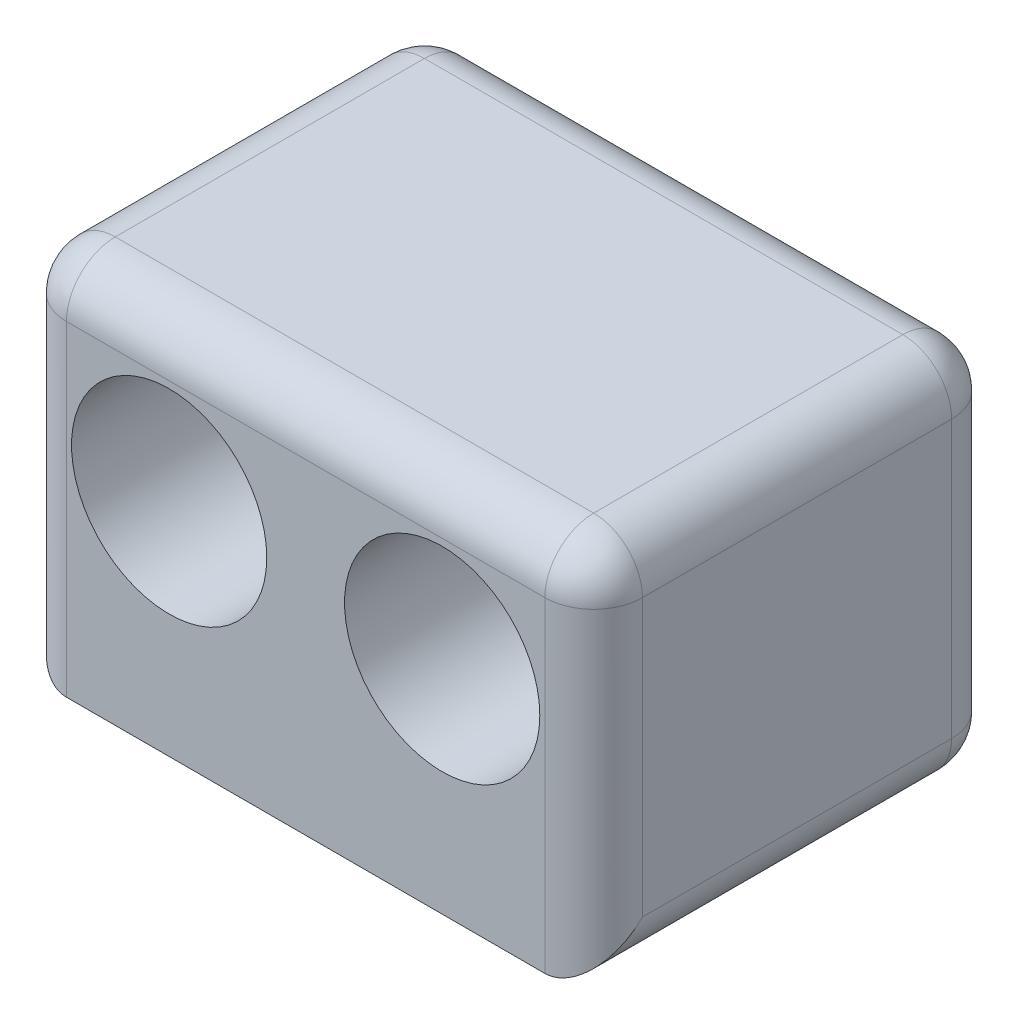
ISO-10303-21;
HEADER;
FILE_DESCRIPTION(('STEP AP214'),'2;1');
FILE_NAME('part.step','',(''),(''),'','','');
FILE_SCHEMA(('AUTOMOTIVE_DESIGN { 1 0 10303 214 1 1 1 1 }'));
ENDSEC;
DATA;
#1=APPLICATION_CONTEXT('core data for automotive mechanical design processes');
#2=APPLICATION_PROTOCOL_DEFINITION('international standard','automotive_design',2000,#1);
#3=PRODUCT_CONTEXT('',#1,'mechanical');
#4=PRODUCT('Part','Part','',(#3));
#5=PRODUCT_RELATED_PRODUCT_CATEGORY('part','',(#4));
#6=PRODUCT_DEFINITION_FORMATION('','',#4);
#7=PRODUCT_DEFINITION_CONTEXT('part definition',#1,'design');
#8=PRODUCT_DEFINITION('design','',#6,#7);
#9=PRODUCT_DEFINITION_SHAPE('','',#8);
#10=(LENGTH_UNIT() NAMED_UNIT(*) SI_UNIT(.MILLI.,.METRE.));
#11=(NAMED_UNIT(*) PLANE_ANGLE_UNIT() SI_UNIT($,.RADIAN.));
#12=(NAMED_UNIT(*) SI_UNIT($,.STERADIAN.) SOLID_ANGLE_UNIT());
#13=UNCERTAINTY_MEASURE_WITH_UNIT(LENGTH_MEASURE(1.E-05),#10,'distance_accuracy_value','');
#14=(GEOMETRIC_REPRESENTATION_CONTEXT(3) GLOBAL_UNCERTAINTY_ASSIGNED_CONTEXT((#13)) GLOBAL_UNIT_ASSIGNED_CONTEXT((#10,
#11,#12)) REPRESENTATION_CONTEXT('',''));
#15=CARTESIAN_POINT('',(0.,0.,0.));
#16=DIRECTION('',(0.,0.,1.));
#17=DIRECTION('',(1.,0.,0.));
#18=AXIS2_PLACEMENT_3D('',#15,#16,#17);
#19=CARTESIAN_POINT('',(8.85,5.75,12.5));
#20=DIRECTION('',(-1.,0.,0.));
#21=DIRECTION('',(0.,-1.,0.));
#22=AXIS2_PLACEMENT_3D('',#19,#20,#21);
#23=PLANE('',#22);
#24=DIRECTION('',(0.,1.,0.));
#25=VECTOR('',#24,1.);
#26=CARTESIAN_POINT('',(8.85,-5.75,11.));
#27=LINE('',#26,#25);
#28=CARTESIAN_POINT('',(8.85,4.25,11.));
#29=VERTEX_POINT('',#28);
#30=CARTESIAN_POINT('',(8.85,-4.25,11.));
#31=VERTEX_POINT('',#30);
#32=EDGE_CURVE('E58',#29,#31,#27,.F.);
#33=ORIENTED_EDGE('',*,*,#32,.T.);
#34=DIRECTION('',(0.,0.,-1.));
#35=VECTOR('',#34,1.);
#36=CARTESIAN_POINT('',(8.85,-4.25,12.5));
#37=LINE('',#36,#35);
#38=CARTESIAN_POINT('',(8.85,-4.25,1.5));
#39=VERTEX_POINT('',#38);
#40=EDGE_CURVE('E11',#31,#39,#37,.T.);
#41=ORIENTED_EDGE('',*,*,#40,.T.);
#42=DIRECTION('',(0.,1.,0.));
#43=VECTOR('',#42,1.);
#44=CARTESIAN_POINT('',(8.85,5.75,1.5));
#45=LINE('',#44,#43);
#46=CARTESIAN_POINT('',(8.85,4.25,1.5));
#47=VERTEX_POINT('',#46);
#48=EDGE_CURVE('E47',#39,#47,#45,.T.);
#49=ORIENTED_EDGE('',*,*,#48,.T.);
#50=DIRECTION('',(0.,0.,-1.));
#51=VECTOR('',#50,1.);
#52=CARTESIAN_POINT('',(8.85,4.25,12.5));
#53=LINE('',#52,#51);
#54=EDGE_CURVE('E236',#47,#29,#53,.F.);
#55=ORIENTED_EDGE('',*,*,#54,.T.);
#56=EDGE_LOOP('',(#33,#41,#49,#55));
#57=FACE_BOUND('',#56,.T.);
#58=ADVANCED_FACE('F38',(#57),#23,.F.);
#59=CARTESIAN_POINT('',(-8.85,5.75,12.5));
#60=DIRECTION('',(0.,-1.,0.));
#61=DIRECTION('',(0.,0.,-1.));
#62=AXIS2_PLACEMENT_3D('',#59,#60,#61);
#63=PLANE('',#62);
#64=DIRECTION('',(-1.,0.,0.));
#65=VECTOR('',#64,1.);
#66=CARTESIAN_POINT('',(-8.85,5.75,1.5));
#67=LINE('',#66,#65);
#68=CARTESIAN_POINT('',(7.35,5.75,1.5));
#69=VERTEX_POINT('',#68);
#70=CARTESIAN_POINT('',(-7.35,5.75,1.5));
#71=VERTEX_POINT('',#70);
#72=EDGE_CURVE('E211',#69,#71,#67,.T.);
#73=ORIENTED_EDGE('',*,*,#72,.T.);
#74=DIRECTION('',(0.,0.,-1.));
#75=VECTOR('',#74,1.);
#76=CARTESIAN_POINT('',(-7.35,5.75,12.5));
#77=LINE('',#76,#75);
#78=CARTESIAN_POINT('',(-7.35,5.75,11.));
#79=VERTEX_POINT('',#78);
#80=EDGE_CURVE('E216',#71,#79,#77,.F.);
#81=ORIENTED_EDGE('',*,*,#80,.T.);
#82=DIRECTION('',(-1.,0.,0.));
#83=VECTOR('',#82,1.);
#84=CARTESIAN_POINT('',(8.85,5.75,11.));
#85=LINE('',#84,#83);
#86=CARTESIAN_POINT('',(7.35,5.75,11.));
#87=VERTEX_POINT('',#86);
#88=EDGE_CURVE('E213',#79,#87,#85,.F.);
#89=ORIENTED_EDGE('',*,*,#88,.T.);
#90=DIRECTION('',(0.,0.,-1.));
#91=VECTOR('',#90,1.);
#92=CARTESIAN_POINT('',(7.35,5.75,12.5));
#93=LINE('',#92,#91);
#94=EDGE_CURVE('E209',#87,#69,#93,.T.);
#95=ORIENTED_EDGE('',*,*,#94,.T.);
#96=EDGE_LOOP('',(#73,#81,#89,#95));
#97=FACE_BOUND('',#96,.T.);
#98=ADVANCED_FACE('F265',(#97),#63,.F.);
#99=CARTESIAN_POINT('',(-8.85,5.75,12.5));
#100=DIRECTION('',(1.,0.,0.));
#101=DIRECTION('',(0.,1.,0.));
#102=AXIS2_PLACEMENT_3D('',#99,#100,#101);
#103=PLANE('',#102);
#104=DIRECTION('',(0.,-1.,0.));
#105=VECTOR('',#104,1.);
#106=CARTESIAN_POINT('',(-8.85,5.75,1.5));
#107=LINE('',#106,#105);
#108=CARTESIAN_POINT('',(-8.85,4.25,1.5));
#109=VERTEX_POINT('',#108);
#110=CARTESIAN_POINT('',(-8.85,-4.25,1.5));
#111=VERTEX_POINT('',#110);
#112=EDGE_CURVE('E231',#109,#111,#107,.T.);
#113=ORIENTED_EDGE('',*,*,#112,.T.);
#114=DIRECTION('',(0.,0.,-1.));
#115=VECTOR('',#114,1.);
#116=CARTESIAN_POINT('',(-8.85,-4.25,12.5));
#117=LINE('',#116,#115);
#118=CARTESIAN_POINT('',(-8.85,-4.25,11.));
#119=VERTEX_POINT('',#118);
#120=EDGE_CURVE('E234',#111,#119,#117,.F.);
#121=ORIENTED_EDGE('',*,*,#120,.T.);
#122=DIRECTION('',(0.,-1.,0.));
#123=VECTOR('',#122,1.);
#124=CARTESIAN_POINT('',(-8.85,5.75,11.));
#125=LINE('',#124,#123);
#126=CARTESIAN_POINT('',(-8.85,4.25,11.));
#127=VERTEX_POINT('',#126);
#128=EDGE_CURVE('E153',#119,#127,#125,.F.);
#129=ORIENTED_EDGE('',*,*,#128,.T.);
#130=DIRECTION('',(0.,0.,-1.));
#131=VECTOR('',#130,1.);
#132=CARTESIAN_POINT('',(-8.85,4.25,12.5));
#133=LINE('',#132,#131);
#134=EDGE_CURVE('E228',#127,#109,#133,.T.);
#135=ORIENTED_EDGE('',*,*,#134,.T.);
#136=EDGE_LOOP('',(#113,#121,#129,#135));
#137=FACE_BOUND('',#136,.T.);
#138=ADVANCED_FACE('F279',(#137),#103,.F.);
#139=CARTESIAN_POINT('',(-8.85,-5.75,12.5));
#140=DIRECTION('',(0.,1.,0.));
#141=DIRECTION('',(0.,0.,1.));
#142=AXIS2_PLACEMENT_3D('',#139,#140,#141);
#143=PLANE('',#142);
#144=DIRECTION('',(1.,0.,0.));
#145=VECTOR('',#144,1.);
#146=CARTESIAN_POINT('',(-8.85,-5.75,12.5));
#147=LINE('',#146,#145);
#148=CARTESIAN_POINT('',(-7.35,-5.75,12.5));
#149=VERTEX_POINT('',#148);
#150=CARTESIAN_POINT('',(7.35,-5.75,12.5));
#151=VERTEX_POINT('',#150);
#152=EDGE_CURVE('E124',#149,#151,#147,.T.);
#153=ORIENTED_EDGE('',*,*,#152,.F.);
#154=DIRECTION('',(0.,0.,-1.));
#155=VECTOR('',#154,1.);
#156=CARTESIAN_POINT('',(-7.35,-5.75,12.5));
#157=LINE('',#156,#155);
#158=CARTESIAN_POINT('',(-7.35,-5.75,1.5));
#159=VERTEX_POINT('',#158);
#160=EDGE_CURVE('E135',#149,#159,#157,.T.);
#161=ORIENTED_EDGE('',*,*,#160,.T.);
#162=DIRECTION('',(1.,0.,0.));
#163=VECTOR('',#162,1.);
#164=CARTESIAN_POINT('',(-8.85,-5.75,1.5));
#165=LINE('',#164,#163);
#166=CARTESIAN_POINT('',(7.35,-5.75,1.5));
#167=VERTEX_POINT('',#166);
#168=EDGE_CURVE('E150',#159,#167,#165,.T.);
#169=ORIENTED_EDGE('',*,*,#168,.T.);
#170=DIRECTION('',(0.,0.,-1.));
#171=VECTOR('',#170,1.);
#172=CARTESIAN_POINT('',(7.35,-5.75,12.5));
#173=LINE('',#172,#171);
#174=EDGE_CURVE('E138',#167,#151,#173,.F.);
#175=ORIENTED_EDGE('',*,*,#174,.T.);
#176=EDGE_LOOP('',(#153,#161,#169,#175));
#177=FACE_BOUND('',#176,.T.);
#178=ADVANCED_FACE('F134',(#177),#143,.F.);
#179=CARTESIAN_POINT('',(0.,0.,12.5));
#180=DIRECTION('',(0.,0.,1.));
#181=DIRECTION('',(1.,0.,0.));
#182=AXIS2_PLACEMENT_3D('',#179,#180,#181);
#183=PLANE('',#182);
#184=CARTESIAN_POINT('',(4.195,1.04,12.5));
#185=DIRECTION('',(0.,0.,1.));
#186=DIRECTION('',(1.,0.,0.));
#187=AXIS2_PLACEMENT_3D('',#184,#185,#186);
#188=CIRCLE('',#187,3.);
#189=CARTESIAN_POINT('',(7.195,1.04,12.5));
#190=VERTEX_POINT('',#189);
#191=EDGE_CURVE('E202',#190,#190,#188,.T.);
#192=ORIENTED_EDGE('',*,*,#191,.F.);
#193=EDGE_LOOP('',(#192));
#194=FACE_BOUND('',#193,.T.);
#195=CARTESIAN_POINT('',(-4.195,1.04,12.5));
#196=DIRECTION('',(0.,0.,1.));
#197=DIRECTION('',(1.,0.,0.));
#198=AXIS2_PLACEMENT_3D('',#195,#196,#197);
#199=CIRCLE('',#198,3.);
#200=CARTESIAN_POINT('',(-1.195,1.04,12.5));
#201=VERTEX_POINT('',#200);
#202=EDGE_CURVE('E194',#201,#201,#199,.T.);
#203=ORIENTED_EDGE('',*,*,#202,.F.);
#204=EDGE_LOOP('',(#203));
#205=FACE_BOUND('',#204,.T.);
#206=ORIENTED_EDGE('',*,*,#152,.T.);
#207=DIRECTION('',(0.,1.,0.));
#208=VECTOR('',#207,1.);
#209=CARTESIAN_POINT('',(7.35,5.75,12.5));
#210=LINE('',#209,#208);
#211=CARTESIAN_POINT('',(7.35,4.25,12.5));
#212=VERTEX_POINT('',#211);
#213=EDGE_CURVE('E207',#151,#212,#210,.T.);
#214=ORIENTED_EDGE('',*,*,#213,.T.);
#215=DIRECTION('',(-1.,0.,0.));
#216=VECTOR('',#215,1.);
#217=CARTESIAN_POINT('',(-8.85,4.25,12.5));
#218=LINE('',#217,#216);
#219=CARTESIAN_POINT('',(-7.35,4.25,12.5));
#220=VERTEX_POINT('',#219);
#221=EDGE_CURVE('E127',#212,#220,#218,.T.);
#222=ORIENTED_EDGE('',*,*,#221,.T.);
#223=DIRECTION('',(0.,-1.,0.));
#224=VECTOR('',#223,1.);
#225=CARTESIAN_POINT('',(-7.35,-5.75,12.5));
#226=LINE('',#225,#224);
#227=EDGE_CURVE('E121',#220,#149,#226,.T.);
#228=ORIENTED_EDGE('',*,*,#227,.T.);
#229=EDGE_LOOP('',(#206,#214,#222,#228));
#230=FACE_BOUND('',#229,.T.);
#231=ADVANCED_FACE('F123',(#194,#205,#230),#183,.T.);
#232=CARTESIAN_POINT('',(0.,0.,0.));
#233=DIRECTION('',(0.,0.,1.));
#234=DIRECTION('',(1.,0.,0.));
#235=AXIS2_PLACEMENT_3D('',#232,#233,#234);
#236=PLANE('',#235);
#237=DIRECTION('',(0.,1.,0.));
#238=VECTOR('',#237,1.);
#239=CARTESIAN_POINT('',(7.35,0.,0.));
#240=LINE('',#239,#238);
#241=CARTESIAN_POINT('',(7.35,4.25,0.));
#242=VERTEX_POINT('',#241);
#243=CARTESIAN_POINT('',(7.35,-4.25,0.));
#244=VERTEX_POINT('',#243);
#245=EDGE_CURVE('E149',#242,#244,#240,.F.);
#246=ORIENTED_EDGE('',*,*,#245,.T.);
#247=DIRECTION('',(1.,0.,0.));
#248=VECTOR('',#247,1.);
#249=CARTESIAN_POINT('',(0.,-4.25,0.));
#250=LINE('',#249,#248);
#251=CARTESIAN_POINT('',(-7.35,-4.25,0.));
#252=VERTEX_POINT('',#251);
#253=EDGE_CURVE('E225',#244,#252,#250,.F.);
#254=ORIENTED_EDGE('',*,*,#253,.T.);
#255=DIRECTION('',(0.,-1.,0.));
#256=VECTOR('',#255,1.);
#257=CARTESIAN_POINT('',(-7.35,0.,0.));
#258=LINE('',#257,#256);
#259=CARTESIAN_POINT('',(-7.35,4.25,0.));
#260=VERTEX_POINT('',#259);
#261=EDGE_CURVE('E223',#252,#260,#258,.F.);
#262=ORIENTED_EDGE('',*,*,#261,.T.);
#263=DIRECTION('',(-1.,0.,0.));
#264=VECTOR('',#263,1.);
#265=CARTESIAN_POINT('',(0.,4.25,0.));
#266=LINE('',#265,#264);
#267=EDGE_CURVE('E221',#260,#242,#266,.F.);
#268=ORIENTED_EDGE('',*,*,#267,.T.);
#269=EDGE_LOOP('',(#246,#254,#262,#268));
#270=FACE_BOUND('',#269,.T.);
#271=ADVANCED_FACE('F293',(#270),#236,.F.);
#272=CARTESIAN_POINT('',(-4.195,1.04,2.5));
#273=DIRECTION('',(0.,0.,1.));
#274=DIRECTION('',(1.,0.,0.));
#275=AXIS2_PLACEMENT_3D('',#272,#273,#274);
#276=CYLINDRICAL_SURFACE('',#275,3.);
#277=CARTESIAN_POINT('',(-4.195,1.04,2.5));
#278=DIRECTION('',(0.,0.,1.));
#279=DIRECTION('',(1.,0.,0.));
#280=AXIS2_PLACEMENT_3D('',#277,#278,#279);
#281=CIRCLE('',#280,3.);
#282=CARTESIAN_POINT('',(-1.195,1.04,2.5));
#283=VERTEX_POINT('',#282);
#284=EDGE_CURVE('E197',#283,#283,#281,.T.);
#285=ORIENTED_EDGE('',*,*,#284,.F.);
#286=EDGE_LOOP('',(#285));
#287=FACE_BOUND('',#286,.T.);
#288=ORIENTED_EDGE('',*,*,#202,.T.);
#289=EDGE_LOOP('',(#288));
#290=FACE_BOUND('',#289,.T.);
#291=ADVANCED_FACE('F474',(#287,#290),#276,.F.);
#292=CARTESIAN_POINT('',(-4.195,1.04,2.5));
#293=DIRECTION('',(0.,0.,1.));
#294=DIRECTION('',(1.,0.,0.));
#295=AXIS2_PLACEMENT_3D('',#292,#293,#294);
#296=PLANE('',#295);
#297=ORIENTED_EDGE('',*,*,#284,.T.);
#298=EDGE_LOOP('',(#297));
#299=FACE_BOUND('',#298,.T.);
#300=ADVANCED_FACE('F465',(#299),#296,.T.);
#301=CARTESIAN_POINT('',(4.195,1.04,2.5));
#302=DIRECTION('',(0.,0.,1.));
#303=DIRECTION('',(1.,0.,0.));
#304=AXIS2_PLACEMENT_3D('',#301,#302,#303);
#305=CYLINDRICAL_SURFACE('',#304,3.);
#306=CARTESIAN_POINT('',(4.195,1.04,2.5));
#307=DIRECTION('',(0.,0.,1.));
#308=DIRECTION('',(1.,0.,0.));
#309=AXIS2_PLACEMENT_3D('',#306,#307,#308);
#310=CIRCLE('',#309,3.);
#311=CARTESIAN_POINT('',(7.195,1.04,2.5));
#312=VERTEX_POINT('',#311);
#313=EDGE_CURVE('E139',#312,#312,#310,.T.);
#314=ORIENTED_EDGE('',*,*,#313,.F.);
#315=EDGE_LOOP('',(#314));
#316=FACE_BOUND('',#315,.T.);
#317=ORIENTED_EDGE('',*,*,#191,.T.);
#318=EDGE_LOOP('',(#317));
#319=FACE_BOUND('',#318,.T.);
#320=ADVANCED_FACE('F456',(#316,#319),#305,.F.);
#321=CARTESIAN_POINT('',(4.195,1.04,2.5));
#322=DIRECTION('',(0.,0.,1.));
#323=DIRECTION('',(1.,0.,0.));
#324=AXIS2_PLACEMENT_3D('',#321,#322,#323);
#325=PLANE('',#324);
#326=ORIENTED_EDGE('',*,*,#313,.T.);
#327=EDGE_LOOP('',(#326));
#328=FACE_BOUND('',#327,.T.);
#329=ADVANCED_FACE('F447',(#328),#325,.T.);
#330=CARTESIAN_POINT('',(-8.85,-4.25,1.5));
#331=DIRECTION('',(1.,0.,0.));
#332=DIRECTION('',(0.,0.,-1.));
#333=AXIS2_PLACEMENT_3D('',#330,#331,#332);
#334=CYLINDRICAL_SURFACE('',#333,1.5);
#335=CARTESIAN_POINT('',(-7.35,-4.25,1.5));
#336=DIRECTION('',(-1.,0.,0.));
#337=DIRECTION('',(0.,0.,1.));
#338=AXIS2_PLACEMENT_3D('',#335,#336,#337);
#339=CIRCLE('',#338,1.5);
#340=EDGE_CURVE('E186',#252,#159,#339,.T.);
#341=ORIENTED_EDGE('',*,*,#340,.F.);
#342=ORIENTED_EDGE('',*,*,#253,.F.);
#343=CARTESIAN_POINT('',(7.35,-4.25,1.5));
#344=DIRECTION('',(1.,0.,0.));
#345=DIRECTION('',(0.,0.,-1.));
#346=AXIS2_PLACEMENT_3D('',#343,#344,#345);
#347=CIRCLE('',#346,1.5);
#348=EDGE_CURVE('E188',#167,#244,#347,.T.);
#349=ORIENTED_EDGE('',*,*,#348,.F.);
#350=ORIENTED_EDGE('',*,*,#168,.F.);
#351=EDGE_LOOP('',(#341,#342,#349,#350));
#352=FACE_BOUND('',#351,.T.);
#353=ADVANCED_FACE('F40',(#352),#334,.T.);
#354=CARTESIAN_POINT('',(7.35,5.75,1.5));
#355=DIRECTION('',(0.,1.,0.));
#356=DIRECTION('',(-1.,0.,0.));
#357=AXIS2_PLACEMENT_3D('',#354,#355,#356);
#358=CYLINDRICAL_SURFACE('',#357,1.5);
#359=CARTESIAN_POINT('',(7.35,-4.25,1.5));
#360=DIRECTION('',(0.,-1.,0.));
#361=DIRECTION('',(1.,0.,0.));
#362=AXIS2_PLACEMENT_3D('',#359,#360,#361);
#363=CIRCLE('',#362,1.5);
#364=EDGE_CURVE('E42',#244,#39,#363,.T.);
#365=ORIENTED_EDGE('',*,*,#364,.F.);
#366=ORIENTED_EDGE('',*,*,#245,.F.);
#367=CARTESIAN_POINT('',(7.35,4.25,1.5));
#368=DIRECTION('',(0.,1.,0.));
#369=DIRECTION('',(-1.,0.,0.));
#370=AXIS2_PLACEMENT_3D('',#367,#368,#369);
#371=CIRCLE('',#370,1.5);
#372=EDGE_CURVE('E177',#47,#242,#371,.T.);
#373=ORIENTED_EDGE('',*,*,#372,.F.);
#374=ORIENTED_EDGE('',*,*,#48,.F.);
#375=EDGE_LOOP('',(#365,#366,#373,#374));
#376=FACE_BOUND('',#375,.T.);
#377=ADVANCED_FACE('F297',(#376),#358,.T.);
#378=CARTESIAN_POINT('',(7.35,-4.25,1.5));
#379=DIRECTION('',(0.,0.,1.));
#380=DIRECTION('',(1.,0.,0.));
#381=AXIS2_PLACEMENT_3D('',#378,#379,#380);
#382=SPHERICAL_SURFACE('',#381,1.5);
#383=ORIENTED_EDGE('',*,*,#348,.T.);
#384=ORIENTED_EDGE('',*,*,#364,.T.);
#385=CARTESIAN_POINT('',(7.35,-4.25,1.5));
#386=DIRECTION('',(0.,0.,-1.));
#387=DIRECTION('',(-1.,0.,0.));
#388=AXIS2_PLACEMENT_3D('',#385,#386,#387);
#389=CIRCLE('',#388,1.5);
#390=EDGE_CURVE('E174',#167,#39,#389,.F.);
#391=ORIENTED_EDGE('',*,*,#390,.F.);
#392=EDGE_LOOP('',(#383,#384,#391));
#393=FACE_BOUND('',#392,.T.);
#394=ADVANCED_FACE('F303',(#393),#382,.T.);
#395=CARTESIAN_POINT('',(-7.35,-4.25,1.5));
#396=DIRECTION('',(0.,0.,1.));
#397=DIRECTION('',(1.,0.,0.));
#398=AXIS2_PLACEMENT_3D('',#395,#396,#397);
#399=SPHERICAL_SURFACE('',#398,1.5);
#400=CARTESIAN_POINT('',(-7.35,-4.25,1.5));
#401=DIRECTION('',(0.,0.,-1.));
#402=DIRECTION('',(-1.,0.,0.));
#403=AXIS2_PLACEMENT_3D('',#400,#401,#402);
#404=CIRCLE('',#403,1.5);
#405=EDGE_CURVE('E148',#111,#159,#404,.F.);
#406=ORIENTED_EDGE('',*,*,#405,.F.);
#407=CARTESIAN_POINT('',(-7.35,-4.25,1.5));
#408=DIRECTION('',(0.,-1.,0.));
#409=DIRECTION('',(0.,0.,-1.));
#410=AXIS2_PLACEMENT_3D('',#407,#408,#409);
#411=CIRCLE('',#410,1.5);
#412=EDGE_CURVE('E183',#252,#111,#411,.F.);
#413=ORIENTED_EDGE('',*,*,#412,.F.);
#414=ORIENTED_EDGE('',*,*,#340,.T.);
#415=EDGE_LOOP('',(#406,#413,#414));
#416=FACE_BOUND('',#415,.T.);
#417=ADVANCED_FACE('F305',(#416),#399,.T.);
#418=CARTESIAN_POINT('',(-7.35,5.75,1.5));
#419=DIRECTION('',(0.,-1.,0.));
#420=DIRECTION('',(1.,0.,0.));
#421=AXIS2_PLACEMENT_3D('',#418,#419,#420);
#422=CYLINDRICAL_SURFACE('',#421,1.5);
#423=ORIENTED_EDGE('',*,*,#412,.T.);
#424=ORIENTED_EDGE('',*,*,#112,.F.);
#425=CARTESIAN_POINT('',(-7.35,4.25,1.5));
#426=DIRECTION('',(0.,1.,0.));
#427=DIRECTION('',(0.,0.,1.));
#428=AXIS2_PLACEMENT_3D('',#425,#426,#427);
#429=CIRCLE('',#428,1.5);
#430=EDGE_CURVE('E170',#260,#109,#429,.T.);
#431=ORIENTED_EDGE('',*,*,#430,.F.);
#432=ORIENTED_EDGE('',*,*,#261,.F.);
#433=EDGE_LOOP('',(#423,#424,#431,#432));
#434=FACE_BOUND('',#433,.T.);
#435=ADVANCED_FACE('F282',(#434),#422,.T.);
#436=CARTESIAN_POINT('',(-8.85,4.25,1.5));
#437=DIRECTION('',(-1.,0.,0.));
#438=DIRECTION('',(0.,0.,1.));
#439=AXIS2_PLACEMENT_3D('',#436,#437,#438);
#440=CYLINDRICAL_SURFACE('',#439,1.5);
#441=CARTESIAN_POINT('',(7.35,4.25,1.5));
#442=DIRECTION('',(1.,0.,0.));
#443=DIRECTION('',(0.,1.,0.));
#444=AXIS2_PLACEMENT_3D('',#441,#442,#443);
#445=CIRCLE('',#444,1.5);
#446=EDGE_CURVE('E180',#242,#69,#445,.T.);
#447=ORIENTED_EDGE('',*,*,#446,.F.);
#448=ORIENTED_EDGE('',*,*,#267,.F.);
#449=CARTESIAN_POINT('',(-7.35,4.25,1.5));
#450=DIRECTION('',(-1.,0.,0.));
#451=DIRECTION('',(0.,0.,1.));
#452=AXIS2_PLACEMENT_3D('',#449,#450,#451);
#453=CIRCLE('',#452,1.5);
#454=EDGE_CURVE('E167',#71,#260,#453,.T.);
#455=ORIENTED_EDGE('',*,*,#454,.F.);
#456=ORIENTED_EDGE('',*,*,#72,.F.);
#457=EDGE_LOOP('',(#447,#448,#455,#456));
#458=FACE_BOUND('',#457,.T.);
#459=ADVANCED_FACE('F290',(#458),#440,.T.);
#460=CARTESIAN_POINT('',(7.35,4.25,1.5));
#461=DIRECTION('',(0.,0.,1.));
#462=DIRECTION('',(1.,0.,0.));
#463=AXIS2_PLACEMENT_3D('',#460,#461,#462);
#464=SPHERICAL_SURFACE('',#463,1.5);
#465=ORIENTED_EDGE('',*,*,#372,.T.);
#466=ORIENTED_EDGE('',*,*,#446,.T.);
#467=CARTESIAN_POINT('',(7.35,4.25,1.5));
#468=DIRECTION('',(0.,0.,-1.));
#469=DIRECTION('',(-1.,0.,0.));
#470=AXIS2_PLACEMENT_3D('',#467,#468,#469);
#471=CIRCLE('',#470,1.5);
#472=EDGE_CURVE('E158',#47,#69,#471,.F.);
#473=ORIENTED_EDGE('',*,*,#472,.F.);
#474=EDGE_LOOP('',(#465,#466,#473));
#475=FACE_BOUND('',#474,.T.);
#476=ADVANCED_FACE('F341',(#475),#464,.T.);
#477=CARTESIAN_POINT('',(7.35,-4.25,12.5));
#478=DIRECTION('',(0.,0.,-1.));
#479=DIRECTION('',(-1.,0.,0.));
#480=AXIS2_PLACEMENT_3D('',#477,#478,#479);
#481=CYLINDRICAL_SURFACE('',#480,1.5);
#482=ORIENTED_EDGE('',*,*,#390,.T.);
#483=ORIENTED_EDGE('',*,*,#40,.F.);
#484=CARTESIAN_POINT('',(7.35,-4.25,11.));
#485=DIRECTION('',(0.,-0.707106781186547,-0.707106781186547));
#486=DIRECTION('',(0.,0.707106781186547,-0.707106781186547));
#487=AXIS2_PLACEMENT_3D('',#484,#485,#486);
#488=ELLIPSE('',#487,2.12132034355964,1.5);
#489=EDGE_CURVE('E154',#151,#31,#488,.F.);
#490=ORIENTED_EDGE('',*,*,#489,.F.);
#491=ORIENTED_EDGE('',*,*,#174,.F.);
#492=EDGE_LOOP('',(#482,#483,#490,#491));
#493=FACE_BOUND('',#492,.T.);
#494=ADVANCED_FACE('F302',(#493),#481,.T.);
#495=CARTESIAN_POINT('',(-7.35,-4.25,12.5));
#496=DIRECTION('',(0.,0.,-1.));
#497=DIRECTION('',(-1.,0.,0.));
#498=AXIS2_PLACEMENT_3D('',#495,#496,#497);
#499=CYLINDRICAL_SURFACE('',#498,1.5);
#500=ORIENTED_EDGE('',*,*,#405,.T.);
#501=ORIENTED_EDGE('',*,*,#160,.F.);
#502=CARTESIAN_POINT('',(-7.35,-4.25,11.));
#503=DIRECTION('',(0.,-0.707106781186547,-0.707106781186547));
#504=DIRECTION('',(0.,0.707106781186547,-0.707106781186547));
#505=AXIS2_PLACEMENT_3D('',#502,#503,#504);
#506=ELLIPSE('',#505,2.12132034355964,1.5);
#507=EDGE_CURVE('E145',#119,#149,#506,.F.);
#508=ORIENTED_EDGE('',*,*,#507,.F.);
#509=ORIENTED_EDGE('',*,*,#120,.F.);
#510=EDGE_LOOP('',(#500,#501,#508,#509));
#511=FACE_BOUND('',#510,.T.);
#512=ADVANCED_FACE('F144',(#511),#499,.T.);
#513=CARTESIAN_POINT('',(-7.35,4.25,1.5));
#514=DIRECTION('',(0.,0.,1.));
#515=DIRECTION('',(1.,0.,0.));
#516=AXIS2_PLACEMENT_3D('',#513,#514,#515);
#517=SPHERICAL_SURFACE('',#516,1.5);
#518=ORIENTED_EDGE('',*,*,#454,.T.);
#519=ORIENTED_EDGE('',*,*,#430,.T.);
#520=CARTESIAN_POINT('',(-7.35,4.25,1.5));
#521=DIRECTION('',(0.,0.,-1.));
#522=DIRECTION('',(-1.,0.,0.));
#523=AXIS2_PLACEMENT_3D('',#520,#521,#522);
#524=CIRCLE('',#523,1.5);
#525=EDGE_CURVE('E155',#71,#109,#524,.F.);
#526=ORIENTED_EDGE('',*,*,#525,.F.);
#527=EDGE_LOOP('',(#518,#519,#526));
#528=FACE_BOUND('',#527,.T.);
#529=ADVANCED_FACE('F285',(#528),#517,.T.);
#530=CARTESIAN_POINT('',(7.35,4.25,12.5));
#531=DIRECTION('',(0.,0.,-1.));
#532=DIRECTION('',(-1.,0.,0.));
#533=AXIS2_PLACEMENT_3D('',#530,#531,#532);
#534=CYLINDRICAL_SURFACE('',#533,1.5);
#535=ORIENTED_EDGE('',*,*,#472,.T.);
#536=ORIENTED_EDGE('',*,*,#94,.F.);
#537=CARTESIAN_POINT('',(7.35,4.25,11.));
#538=DIRECTION('',(0.,0.,1.));
#539=DIRECTION('',(1.,0.,0.));
#540=AXIS2_PLACEMENT_3D('',#537,#538,#539);
#541=CIRCLE('',#540,1.5);
#542=EDGE_CURVE('E161',#29,#87,#541,.T.);
#543=ORIENTED_EDGE('',*,*,#542,.F.);
#544=ORIENTED_EDGE('',*,*,#54,.F.);
#545=EDGE_LOOP('',(#535,#536,#543,#544));
#546=FACE_BOUND('',#545,.T.);
#547=ADVANCED_FACE('F260',(#546),#534,.T.);
#548=CARTESIAN_POINT('',(7.35,0.,11.));
#549=DIRECTION('',(0.,-1.,0.));
#550=DIRECTION('',(1.,0.,0.));
#551=AXIS2_PLACEMENT_3D('',#548,#549,#550);
#552=CYLINDRICAL_SURFACE('',#551,1.5);
#553=ORIENTED_EDGE('',*,*,#489,.T.);
#554=ORIENTED_EDGE('',*,*,#32,.F.);
#555=CARTESIAN_POINT('',(7.35,4.25,11.));
#556=DIRECTION('',(0.,1.,0.));
#557=DIRECTION('',(-1.,0.,0.));
#558=AXIS2_PLACEMENT_3D('',#555,#556,#557);
#559=CIRCLE('',#558,1.5);
#560=EDGE_CURVE('E250',#212,#29,#559,.T.);
#561=ORIENTED_EDGE('',*,*,#560,.F.);
#562=ORIENTED_EDGE('',*,*,#213,.F.);
#563=EDGE_LOOP('',(#553,#554,#561,#562));
#564=FACE_BOUND('',#563,.T.);
#565=ADVANCED_FACE('F299',(#564),#552,.T.);
#566=CARTESIAN_POINT('',(-7.35,0.,11.));
#567=DIRECTION('',(0.,1.,0.));
#568=DIRECTION('',(-1.,0.,0.));
#569=AXIS2_PLACEMENT_3D('',#566,#567,#568);
#570=CYLINDRICAL_SURFACE('',#569,1.5);
#571=ORIENTED_EDGE('',*,*,#507,.T.);
#572=ORIENTED_EDGE('',*,*,#227,.F.);
#573=CARTESIAN_POINT('',(-7.35,4.25,11.));
#574=DIRECTION('',(0.,1.,0.));
#575=DIRECTION('',(0.,0.,1.));
#576=AXIS2_PLACEMENT_3D('',#573,#574,#575);
#577=CIRCLE('',#576,1.5);
#578=EDGE_CURVE('E247',#127,#220,#577,.T.);
#579=ORIENTED_EDGE('',*,*,#578,.F.);
#580=ORIENTED_EDGE('',*,*,#128,.F.);
#581=EDGE_LOOP('',(#571,#572,#579,#580));
#582=FACE_BOUND('',#581,.T.);
#583=ADVANCED_FACE('F152',(#582),#570,.T.);
#584=CARTESIAN_POINT('',(-7.35,4.25,12.5));
#585=DIRECTION('',(0.,0.,-1.));
#586=DIRECTION('',(-1.,0.,0.));
#587=AXIS2_PLACEMENT_3D('',#584,#585,#586);
#588=CYLINDRICAL_SURFACE('',#587,1.5);
#589=ORIENTED_EDGE('',*,*,#525,.T.);
#590=ORIENTED_EDGE('',*,*,#134,.F.);
#591=CARTESIAN_POINT('',(-7.35,4.25,11.));
#592=DIRECTION('',(0.,0.,1.));
#593=DIRECTION('',(1.,0.,0.));
#594=AXIS2_PLACEMENT_3D('',#591,#592,#593);
#595=CIRCLE('',#594,1.5);
#596=EDGE_CURVE('E244',#79,#127,#595,.T.);
#597=ORIENTED_EDGE('',*,*,#596,.F.);
#598=ORIENTED_EDGE('',*,*,#80,.F.);
#599=EDGE_LOOP('',(#589,#590,#597,#598));
#600=FACE_BOUND('',#599,.T.);
#601=ADVANCED_FACE('F275',(#600),#588,.T.);
#602=CARTESIAN_POINT('',(7.35,4.25,11.));
#603=DIRECTION('',(0.,0.,1.));
#604=DIRECTION('',(1.,0.,0.));
#605=AXIS2_PLACEMENT_3D('',#602,#603,#604);
#606=SPHERICAL_SURFACE('',#605,1.5);
#607=ORIENTED_EDGE('',*,*,#560,.T.);
#608=ORIENTED_EDGE('',*,*,#542,.T.);
#609=CARTESIAN_POINT('',(7.35,4.25,11.));
#610=DIRECTION('',(1.,0.,0.));
#611=DIRECTION('',(0.,0.,-1.));
#612=AXIS2_PLACEMENT_3D('',#609,#610,#611);
#613=CIRCLE('',#612,1.5);
#614=EDGE_CURVE('E242',#212,#87,#613,.F.);
#615=ORIENTED_EDGE('',*,*,#614,.F.);
#616=EDGE_LOOP('',(#607,#608,#615));
#617=FACE_BOUND('',#616,.T.);
#618=ADVANCED_FACE('F257',(#617),#606,.T.);
#619=CARTESIAN_POINT('',(-7.35,4.25,11.));
#620=DIRECTION('',(0.,0.,1.));
#621=DIRECTION('',(1.,0.,0.));
#622=AXIS2_PLACEMENT_3D('',#619,#620,#621);
#623=SPHERICAL_SURFACE('',#622,1.5);
#624=ORIENTED_EDGE('',*,*,#596,.T.);
#625=ORIENTED_EDGE('',*,*,#578,.T.);
#626=CARTESIAN_POINT('',(-7.35,4.25,11.));
#627=DIRECTION('',(-1.,0.,0.));
#628=DIRECTION('',(0.,0.,1.));
#629=AXIS2_PLACEMENT_3D('',#626,#627,#628);
#630=CIRCLE('',#629,1.5);
#631=EDGE_CURVE('E240',#79,#220,#630,.F.);
#632=ORIENTED_EDGE('',*,*,#631,.F.);
#633=EDGE_LOOP('',(#624,#625,#632));
#634=FACE_BOUND('',#633,.T.);
#635=ADVANCED_FACE('F272',(#634),#623,.T.);
#636=CARTESIAN_POINT('',(0.,4.25,11.));
#637=DIRECTION('',(1.,0.,0.));
#638=DIRECTION('',(0.,0.,-1.));
#639=AXIS2_PLACEMENT_3D('',#636,#637,#638);
#640=CYLINDRICAL_SURFACE('',#639,1.5);
#641=ORIENTED_EDGE('',*,*,#614,.T.);
#642=ORIENTED_EDGE('',*,*,#88,.F.);
#643=ORIENTED_EDGE('',*,*,#631,.T.);
#644=ORIENTED_EDGE('',*,*,#221,.F.);
#645=EDGE_LOOP('',(#641,#642,#643,#644));
#646=FACE_BOUND('',#645,.T.);
#647=ADVANCED_FACE('F270',(#646),#640,.T.);
#648=CLOSED_SHELL('',(#58,#98,#138,#178,#231,#271,#291,#300,#320,#329,#353,#377,#394,#417,#435,
#459,#476,#494,#512,#529,#547,#565,#583,#601,#618,#635,#647));
#649=MANIFOLD_SOLID_BREP('B2',#648);
#650=ADVANCED_BREP_SHAPE_REPRESENTATION('',(#18,#649),#14);
#651=SHAPE_DEFINITION_REPRESENTATION(#9,#650);
ENDSEC;
END-ISO-10303-21;
